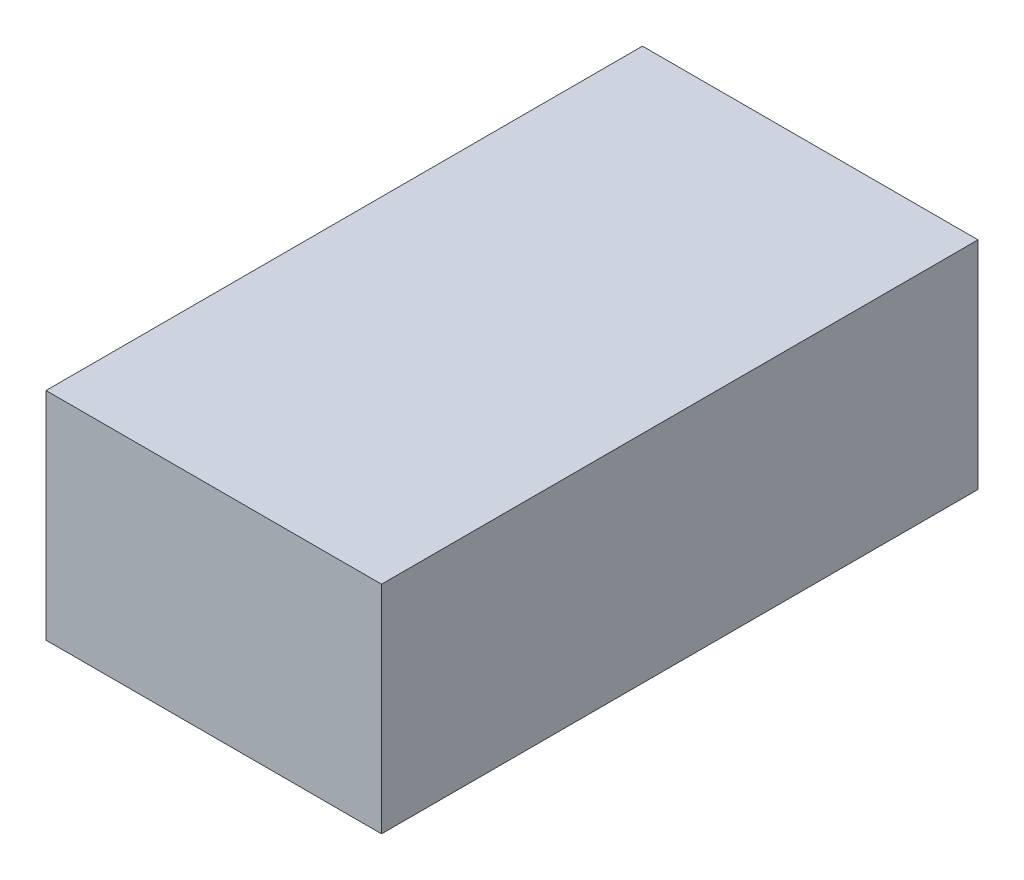
ISO-10303-21;
HEADER;
FILE_DESCRIPTION(('STEP AP214'),'2;1');
FILE_NAME('part.step','',(''),(''),'','','');
FILE_SCHEMA(('AUTOMOTIVE_DESIGN { 1 0 10303 214 1 1 1 1 }'));
ENDSEC;
DATA;
#1=APPLICATION_CONTEXT('core data for automotive mechanical design processes');
#2=APPLICATION_PROTOCOL_DEFINITION('international standard','automotive_design',2000,#1);
#3=PRODUCT_CONTEXT('',#1,'mechanical');
#4=PRODUCT('Part','Part','',(#3));
#5=PRODUCT_RELATED_PRODUCT_CATEGORY('part','',(#4));
#6=PRODUCT_DEFINITION_FORMATION('','',#4);
#7=PRODUCT_DEFINITION_CONTEXT('part definition',#1,'design');
#8=PRODUCT_DEFINITION('design','',#6,#7);
#9=PRODUCT_DEFINITION_SHAPE('','',#8);
#10=(LENGTH_UNIT() NAMED_UNIT(*) SI_UNIT(.MILLI.,.METRE.));
#11=(NAMED_UNIT(*) PLANE_ANGLE_UNIT() SI_UNIT($,.RADIAN.));
#12=(NAMED_UNIT(*) SI_UNIT($,.STERADIAN.) SOLID_ANGLE_UNIT());
#13=UNCERTAINTY_MEASURE_WITH_UNIT(LENGTH_MEASURE(1.E-05),#10,'distance_accuracy_value','');
#14=(GEOMETRIC_REPRESENTATION_CONTEXT(3) GLOBAL_UNCERTAINTY_ASSIGNED_CONTEXT((#13)) GLOBAL_UNIT_ASSIGNED_CONTEXT((#10,
#11,#12)) REPRESENTATION_CONTEXT('',''));
#15=CARTESIAN_POINT('',(0.,0.,0.));
#16=DIRECTION('',(0.,0.,1.));
#17=DIRECTION('',(1.,0.,0.));
#18=AXIS2_PLACEMENT_3D('',#15,#16,#17);
#19=CARTESIAN_POINT('',(22.5,29.,40.));
#20=DIRECTION('',(-1.,0.,0.));
#21=DIRECTION('',(0.,0.,1.));
#22=AXIS2_PLACEMENT_3D('',#19,#20,#21);
#23=PLANE('',#22);
#24=DIRECTION('',(0.,0.,-1.));
#25=VECTOR('',#24,1.);
#26=CARTESIAN_POINT('',(22.5,0.,40.));
#27=LINE('',#26,#25);
#28=CARTESIAN_POINT('',(22.5,0.,40.));
#29=VERTEX_POINT('',#28);
#30=CARTESIAN_POINT('',(22.5,0.,-40.));
#31=VERTEX_POINT('',#30);
#32=EDGE_CURVE('E111',#29,#31,#27,.T.);
#33=ORIENTED_EDGE('',*,*,#32,.T.);
#34=DIRECTION('',(0.,-1.,0.));
#35=VECTOR('',#34,1.);
#36=CARTESIAN_POINT('',(22.5,29.,-40.));
#37=LINE('',#36,#35);
#38=CARTESIAN_POINT('',(22.5,29.,-40.));
#39=VERTEX_POINT('',#38);
#40=EDGE_CURVE('E11',#39,#31,#37,.T.);
#41=ORIENTED_EDGE('',*,*,#40,.F.);
#42=DIRECTION('',(0.,0.,-1.));
#43=VECTOR('',#42,1.);
#44=CARTESIAN_POINT('',(22.5,29.,40.));
#45=LINE('',#44,#43);
#46=CARTESIAN_POINT('',(22.5,29.,40.));
#47=VERTEX_POINT('',#46);
#48=EDGE_CURVE('E95',#47,#39,#45,.T.);
#49=ORIENTED_EDGE('',*,*,#48,.F.);
#50=DIRECTION('',(0.,-1.,0.));
#51=VECTOR('',#50,1.);
#52=CARTESIAN_POINT('',(22.5,29.,40.));
#53=LINE('',#52,#51);
#54=EDGE_CURVE('E107',#47,#29,#53,.T.);
#55=ORIENTED_EDGE('',*,*,#54,.T.);
#56=EDGE_LOOP('',(#33,#41,#49,#55));
#57=FACE_BOUND('',#56,.T.);
#58=ADVANCED_FACE('F43',(#57),#23,.F.);
#59=CARTESIAN_POINT('',(-22.5,29.,-40.));
#60=DIRECTION('',(0.,0.,1.));
#61=DIRECTION('',(1.,0.,0.));
#62=AXIS2_PLACEMENT_3D('',#59,#60,#61);
#63=PLANE('',#62);
#64=DIRECTION('',(-1.,0.,0.));
#65=VECTOR('',#64,1.);
#66=CARTESIAN_POINT('',(-22.5,0.,-40.));
#67=LINE('',#66,#65);
#68=CARTESIAN_POINT('',(-22.5,0.,-40.));
#69=VERTEX_POINT('',#68);
#70=EDGE_CURVE('E100',#31,#69,#67,.T.);
#71=ORIENTED_EDGE('',*,*,#70,.T.);
#72=DIRECTION('',(0.,-1.,0.));
#73=VECTOR('',#72,1.);
#74=CARTESIAN_POINT('',(-22.5,29.,-40.));
#75=LINE('',#74,#73);
#76=CARTESIAN_POINT('',(-22.5,29.,-40.));
#77=VERTEX_POINT('',#76);
#78=EDGE_CURVE('E52',#77,#69,#75,.T.);
#79=ORIENTED_EDGE('',*,*,#78,.F.);
#80=DIRECTION('',(-1.,0.,0.));
#81=VECTOR('',#80,1.);
#82=CARTESIAN_POINT('',(-22.5,29.,-40.));
#83=LINE('',#82,#81);
#84=EDGE_CURVE('E90',#39,#77,#83,.T.);
#85=ORIENTED_EDGE('',*,*,#84,.F.);
#86=ORIENTED_EDGE('',*,*,#40,.T.);
#87=EDGE_LOOP('',(#71,#79,#85,#86));
#88=FACE_BOUND('',#87,.T.);
#89=ADVANCED_FACE('F99',(#88),#63,.F.);
#90=CARTESIAN_POINT('',(-22.5,29.,40.));
#91=DIRECTION('',(1.,0.,0.));
#92=DIRECTION('',(0.,0.,-1.));
#93=AXIS2_PLACEMENT_3D('',#90,#91,#92);
#94=PLANE('',#93);
#95=DIRECTION('',(0.,0.,1.));
#96=VECTOR('',#95,1.);
#97=CARTESIAN_POINT('',(-22.5,0.,40.));
#98=LINE('',#97,#96);
#99=CARTESIAN_POINT('',(-22.5,0.,40.));
#100=VERTEX_POINT('',#99);
#101=EDGE_CURVE('E77',#69,#100,#98,.T.);
#102=ORIENTED_EDGE('',*,*,#101,.T.);
#103=DIRECTION('',(0.,-1.,0.));
#104=VECTOR('',#103,1.);
#105=CARTESIAN_POINT('',(-22.5,29.,40.));
#106=LINE('',#105,#104);
#107=CARTESIAN_POINT('',(-22.5,29.,40.));
#108=VERTEX_POINT('',#107);
#109=EDGE_CURVE('E102',#108,#100,#106,.T.);
#110=ORIENTED_EDGE('',*,*,#109,.F.);
#111=DIRECTION('',(0.,0.,1.));
#112=VECTOR('',#111,1.);
#113=CARTESIAN_POINT('',(-22.5,29.,40.));
#114=LINE('',#113,#112);
#115=EDGE_CURVE('E93',#77,#108,#114,.T.);
#116=ORIENTED_EDGE('',*,*,#115,.F.);
#117=ORIENTED_EDGE('',*,*,#78,.T.);
#118=EDGE_LOOP('',(#102,#110,#116,#117));
#119=FACE_BOUND('',#118,.T.);
#120=ADVANCED_FACE('F103',(#119),#94,.F.);
#121=CARTESIAN_POINT('',(-22.5,29.,40.));
#122=DIRECTION('',(0.,0.,-1.));
#123=DIRECTION('',(-1.,0.,0.));
#124=AXIS2_PLACEMENT_3D('',#121,#122,#123);
#125=PLANE('',#124);
#126=DIRECTION('',(1.,0.,0.));
#127=VECTOR('',#126,1.);
#128=CARTESIAN_POINT('',(-22.5,0.,40.));
#129=LINE('',#128,#127);
#130=EDGE_CURVE('E83',#100,#29,#129,.T.);
#131=ORIENTED_EDGE('',*,*,#130,.T.);
#132=ORIENTED_EDGE('',*,*,#54,.F.);
#133=DIRECTION('',(1.,0.,0.));
#134=VECTOR('',#133,1.);
#135=CARTESIAN_POINT('',(-22.5,29.,40.));
#136=LINE('',#135,#134);
#137=EDGE_CURVE('E60',#108,#47,#136,.T.);
#138=ORIENTED_EDGE('',*,*,#137,.F.);
#139=ORIENTED_EDGE('',*,*,#109,.T.);
#140=EDGE_LOOP('',(#131,#132,#138,#139));
#141=FACE_BOUND('',#140,.T.);
#142=ADVANCED_FACE('F124',(#141),#125,.F.);
#143=CARTESIAN_POINT('',(0.,29.,0.));
#144=DIRECTION('',(0.,-1.,0.));
#145=DIRECTION('',(0.,0.,-1.));
#146=AXIS2_PLACEMENT_3D('',#143,#144,#145);
#147=PLANE('',#146);
#148=ORIENTED_EDGE('',*,*,#48,.T.);
#149=ORIENTED_EDGE('',*,*,#84,.T.);
#150=ORIENTED_EDGE('',*,*,#115,.T.);
#151=ORIENTED_EDGE('',*,*,#137,.T.);
#152=EDGE_LOOP('',(#148,#149,#150,#151));
#153=FACE_BOUND('',#152,.T.);
#154=ADVANCED_FACE('F91',(#153),#147,.F.);
#155=CARTESIAN_POINT('',(0.,0.,0.));
#156=DIRECTION('',(0.,-1.,0.));
#157=DIRECTION('',(0.,0.,-1.));
#158=AXIS2_PLACEMENT_3D('',#155,#156,#157);
#159=PLANE('',#158);
#160=ORIENTED_EDGE('',*,*,#32,.F.);
#161=ORIENTED_EDGE('',*,*,#130,.F.);
#162=ORIENTED_EDGE('',*,*,#101,.F.);
#163=ORIENTED_EDGE('',*,*,#70,.F.);
#164=EDGE_LOOP('',(#160,#161,#162,#163));
#165=FACE_BOUND('',#164,.T.);
#166=ADVANCED_FACE('F127',(#165),#159,.T.);
#167=CLOSED_SHELL('',(#58,#89,#120,#142,#154,#166));
#168=MANIFOLD_SOLID_BREP('B2',#167);
#169=ADVANCED_BREP_SHAPE_REPRESENTATION('',(#18,#168),#14);
#170=SHAPE_DEFINITION_REPRESENTATION(#9,#169);
ENDSEC;
END-ISO-10303-21;
